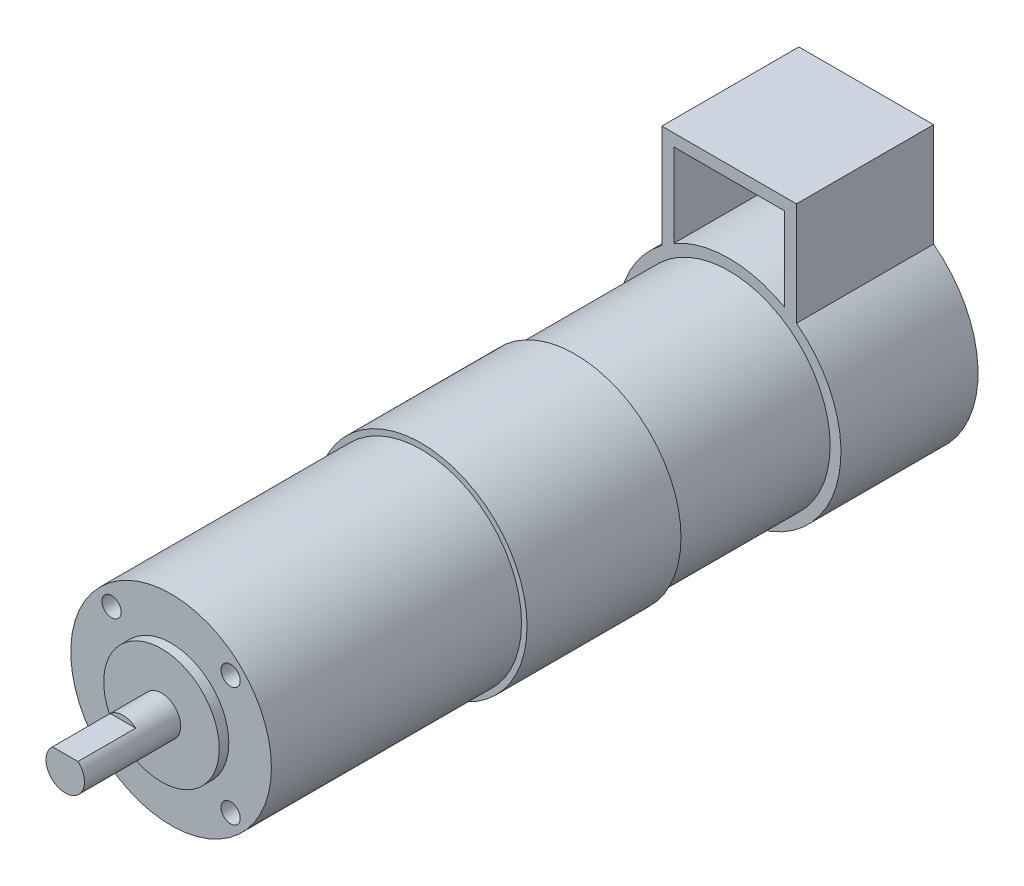
ISO-10303-21;
HEADER;
FILE_DESCRIPTION(('STEP AP214'),'2;1');
FILE_NAME('part.step','',(''),(''),'','','');
FILE_SCHEMA(('AUTOMOTIVE_DESIGN { 1 0 10303 214 1 1 1 1 }'));
ENDSEC;
DATA;
#1=APPLICATION_CONTEXT('core data for automotive mechanical design processes');
#2=APPLICATION_PROTOCOL_DEFINITION('international standard','automotive_design',2000,#1);
#3=PRODUCT_CONTEXT('',#1,'mechanical');
#4=PRODUCT('Part','Part','',(#3));
#5=PRODUCT_RELATED_PRODUCT_CATEGORY('part','',(#4));
#6=PRODUCT_DEFINITION_FORMATION('','',#4);
#7=PRODUCT_DEFINITION_CONTEXT('part definition',#1,'design');
#8=PRODUCT_DEFINITION('design','',#6,#7);
#9=PRODUCT_DEFINITION_SHAPE('','',#8);
#10=(LENGTH_UNIT() NAMED_UNIT(*) SI_UNIT(.MILLI.,.METRE.));
#11=(NAMED_UNIT(*) PLANE_ANGLE_UNIT() SI_UNIT($,.RADIAN.));
#12=(NAMED_UNIT(*) SI_UNIT($,.STERADIAN.) SOLID_ANGLE_UNIT());
#13=UNCERTAINTY_MEASURE_WITH_UNIT(LENGTH_MEASURE(1.E-05),#10,'distance_accuracy_value','');
#14=(GEOMETRIC_REPRESENTATION_CONTEXT(3) GLOBAL_UNCERTAINTY_ASSIGNED_CONTEXT((#13)) GLOBAL_UNIT_ASSIGNED_CONTEXT((#10,
#11,#12)) REPRESENTATION_CONTEXT('',''));
#15=CARTESIAN_POINT('',(0.,0.,0.));
#16=DIRECTION('',(0.,0.,1.));
#17=DIRECTION('',(1.,0.,0.));
#18=AXIS2_PLACEMENT_3D('',#15,#16,#17);
#19=CARTESIAN_POINT('',(0.,0.,-76.5));
#20=DIRECTION('',(0.,0.,1.));
#21=DIRECTION('',(1.,0.,0.));
#22=AXIS2_PLACEMENT_3D('',#19,#20,#21);
#23=CYLINDRICAL_SURFACE('',#22,23.25);
#24=CARTESIAN_POINT('',(0.,0.,-74.5));
#25=DIRECTION('',(0.,0.,-1.));
#26=DIRECTION('',(-1.,0.,0.));
#27=AXIS2_PLACEMENT_3D('',#24,#25,#26);
#28=CIRCLE('',#27,23.25);
#29=CARTESIAN_POINT('',(-11.5,20.2067439237498,-74.5));
#30=VERTEX_POINT('',#29);
#31=CARTESIAN_POINT('',(11.5,20.2067439237498,-74.5));
#32=VERTEX_POINT('',#31);
#33=EDGE_CURVE('E58',#30,#32,#28,.T.);
#34=ORIENTED_EDGE('',*,*,#33,.F.);
#35=DIRECTION('',(0.,0.,-1.));
#36=VECTOR('',#35,1.);
#37=CARTESIAN_POINT('',(-11.5,20.2067439237498,-48.));
#38=LINE('',#37,#36);
#39=CARTESIAN_POINT('',(-11.5,20.2067439237498,-48.));
#40=VERTEX_POINT('',#39);
#41=EDGE_CURVE('E201',#40,#30,#38,.T.);
#42=ORIENTED_EDGE('',*,*,#41,.F.);
#43=CARTESIAN_POINT('',(0.,0.,-48.));
#44=DIRECTION('',(0.,0.,-1.));
#45=DIRECTION('',(-1.,0.,0.));
#46=AXIS2_PLACEMENT_3D('',#43,#44,#45);
#47=CIRCLE('',#46,23.25);
#48=CARTESIAN_POINT('',(11.5,20.2067439237498,-48.));
#49=VERTEX_POINT('',#48);
#50=EDGE_CURVE('E218',#40,#49,#47,.T.);
#51=ORIENTED_EDGE('',*,*,#50,.T.);
#52=DIRECTION('',(0.,0.,-1.));
#53=VECTOR('',#52,1.);
#54=CARTESIAN_POINT('',(11.5,20.2067439237498,-48.));
#55=LINE('',#54,#53);
#56=EDGE_CURVE('E208',#49,#32,#55,.T.);
#57=ORIENTED_EDGE('',*,*,#56,.T.);
#58=EDGE_LOOP('',(#34,#42,#51,#57));
#59=FACE_BOUND('',#58,.T.);
#60=ADVANCED_FACE('F35',(#59),#23,.T.);
#61=CARTESIAN_POINT('',(-11.5,37.5623947808466,-48.));
#62=DIRECTION('',(1.,0.,0.));
#63=DIRECTION('',(0.,0.,-1.));
#64=AXIS2_PLACEMENT_3D('',#61,#62,#63);
#65=PLANE('',#64);
#66=ORIENTED_EDGE('',*,*,#41,.T.);
#67=DIRECTION('',(0.,1.,0.));
#68=VECTOR('',#67,1.);
#69=CARTESIAN_POINT('',(-11.5,37.5623947808466,-74.5));
#70=LINE('',#69,#68);
#71=CARTESIAN_POINT('',(-11.5,37.5623947808466,-74.5));
#72=VERTEX_POINT('',#71);
#73=EDGE_CURVE('E131',#30,#72,#70,.T.);
#74=ORIENTED_EDGE('',*,*,#73,.T.);
#75=DIRECTION('',(0.,0.,-1.));
#76=VECTOR('',#75,1.);
#77=CARTESIAN_POINT('',(-11.5,37.5623947808466,-48.));
#78=LINE('',#77,#76);
#79=CARTESIAN_POINT('',(-11.5,37.5623947808466,-48.));
#80=VERTEX_POINT('',#79);
#81=EDGE_CURVE('E203',#80,#72,#78,.T.);
#82=ORIENTED_EDGE('',*,*,#81,.F.);
#83=DIRECTION('',(0.,-1.,0.));
#84=VECTOR('',#83,1.);
#85=CARTESIAN_POINT('',(-11.5,37.5623947808466,-48.));
#86=LINE('',#85,#84);
#87=EDGE_CURVE('E182',#80,#40,#86,.T.);
#88=ORIENTED_EDGE('',*,*,#87,.T.);
#89=EDGE_LOOP('',(#66,#74,#82,#88));
#90=FACE_BOUND('',#89,.T.);
#91=ADVANCED_FACE('F255',(#90),#65,.T.);
#92=CARTESIAN_POINT('',(-11.5,37.5623947808466,-48.));
#93=DIRECTION('',(0.,1.,0.));
#94=DIRECTION('',(0.,0.,1.));
#95=AXIS2_PLACEMENT_3D('',#92,#93,#94);
#96=PLANE('',#95);
#97=DIRECTION('',(-1.,0.,0.));
#98=VECTOR('',#97,1.);
#99=CARTESIAN_POINT('',(-11.5,37.5623947808466,-74.5));
#100=LINE('',#99,#98);
#101=CARTESIAN_POINT('',(11.5,37.5623947808466,-74.5));
#102=VERTEX_POINT('',#101);
#103=EDGE_CURVE('E127',#102,#72,#100,.T.);
#104=ORIENTED_EDGE('',*,*,#103,.F.);
#105=DIRECTION('',(0.,0.,-1.));
#106=VECTOR('',#105,1.);
#107=CARTESIAN_POINT('',(11.5,37.5623947808466,-48.));
#108=LINE('',#107,#106);
#109=CARTESIAN_POINT('',(11.5,37.5623947808466,-48.));
#110=VERTEX_POINT('',#109);
#111=EDGE_CURVE('E206',#110,#102,#108,.T.);
#112=ORIENTED_EDGE('',*,*,#111,.F.);
#113=DIRECTION('',(1.,0.,0.));
#114=VECTOR('',#113,1.);
#115=CARTESIAN_POINT('',(-11.5,37.5623947808466,-48.));
#116=LINE('',#115,#114);
#117=EDGE_CURVE('E180',#80,#110,#116,.T.);
#118=ORIENTED_EDGE('',*,*,#117,.F.);
#119=ORIENTED_EDGE('',*,*,#81,.T.);
#120=EDGE_LOOP('',(#104,#112,#118,#119));
#121=FACE_BOUND('',#120,.T.);
#122=ADVANCED_FACE('F253',(#121),#96,.F.);
#123=CARTESIAN_POINT('',(11.5,37.5623947808466,-48.));
#124=DIRECTION('',(1.,0.,0.));
#125=DIRECTION('',(0.,0.,-1.));
#126=AXIS2_PLACEMENT_3D('',#123,#124,#125);
#127=PLANE('',#126);
#128=DIRECTION('',(0.,1.,0.));
#129=VECTOR('',#128,1.);
#130=CARTESIAN_POINT('',(11.5,37.5623947808466,-74.5));
#131=LINE('',#130,#129);
#132=EDGE_CURVE('E119',#32,#102,#131,.T.);
#133=ORIENTED_EDGE('',*,*,#132,.F.);
#134=ORIENTED_EDGE('',*,*,#56,.F.);
#135=DIRECTION('',(0.,-1.,0.));
#136=VECTOR('',#135,1.);
#137=CARTESIAN_POINT('',(11.5,37.5623947808466,-48.));
#138=LINE('',#137,#136);
#139=EDGE_CURVE('E177',#110,#49,#138,.T.);
#140=ORIENTED_EDGE('',*,*,#139,.F.);
#141=ORIENTED_EDGE('',*,*,#111,.T.);
#142=EDGE_LOOP('',(#133,#134,#140,#141));
#143=FACE_BOUND('',#142,.T.);
#144=ADVANCED_FACE('F244',(#143),#127,.F.);
#145=DIRECTION('',(0.,0.,-1.));
#146=VECTOR('',#145,1.);
#147=CARTESIAN_POINT('',(-14.,18.5623947808466,-48.));
#148=LINE('',#147,#146);
#149=CARTESIAN_POINT('',(-14.,18.5623947808466,-48.));
#150=VERTEX_POINT('',#149);
#151=CARTESIAN_POINT('',(-14.,18.5623947808466,-76.5));
#152=VERTEX_POINT('',#151);
#153=EDGE_CURVE('E199',#150,#152,#148,.T.);
#154=ORIENTED_EDGE('',*,*,#153,.T.);
#155=CARTESIAN_POINT('',(0.,0.,-76.5));
#156=DIRECTION('',(0.,0.,-1.));
#157=DIRECTION('',(-1.,0.,0.));
#158=AXIS2_PLACEMENT_3D('',#155,#156,#157);
#159=CIRCLE('',#158,23.25);
#160=CARTESIAN_POINT('',(14.,18.5623947808466,-76.5));
#161=VERTEX_POINT('',#160);
#162=EDGE_CURVE('E214',#161,#152,#159,.T.);
#163=ORIENTED_EDGE('',*,*,#162,.F.);
#164=DIRECTION('',(0.,0.,-1.));
#165=VECTOR('',#164,1.);
#166=CARTESIAN_POINT('',(14.,18.5623947808466,-48.));
#167=LINE('',#166,#165);
#168=CARTESIAN_POINT('',(14.,18.5623947808466,-48.));
#169=VERTEX_POINT('',#168);
#170=EDGE_CURVE('E210',#169,#161,#167,.T.);
#171=ORIENTED_EDGE('',*,*,#170,.F.);
#172=EDGE_CURVE('E198',#169,#150,#47,.T.);
#173=ORIENTED_EDGE('',*,*,#172,.T.);
#174=EDGE_LOOP('',(#154,#163,#171,#173));
#175=FACE_BOUND('',#174,.T.);
#176=ADVANCED_FACE('F264',(#175),#23,.T.);
#177=CARTESIAN_POINT('',(0.,0.,-16.));
#178=DIRECTION('',(0.,0.,1.));
#179=DIRECTION('',(1.,0.,0.));
#180=AXIS2_PLACEMENT_3D('',#177,#178,#179);
#181=CYLINDRICAL_SURFACE('',#180,22.);
#182=CARTESIAN_POINT('',(0.,0.,-16.));
#183=DIRECTION('',(0.,0.,1.));
#184=DIRECTION('',(1.,0.,0.));
#185=AXIS2_PLACEMENT_3D('',#182,#183,#184);
#186=CIRCLE('',#185,22.);
#187=CARTESIAN_POINT('',(22.,0.,-16.));
#188=VERTEX_POINT('',#187);
#189=EDGE_CURVE('E231',#188,#188,#186,.T.);
#190=ORIENTED_EDGE('',*,*,#189,.T.);
#191=EDGE_LOOP('',(#190));
#192=FACE_BOUND('',#191,.T.);
#193=CARTESIAN_POINT('',(0.,0.,16.));
#194=DIRECTION('',(0.,0.,1.));
#195=DIRECTION('',(1.,0.,0.));
#196=AXIS2_PLACEMENT_3D('',#193,#194,#195);
#197=CIRCLE('',#196,22.);
#198=CARTESIAN_POINT('',(22.,0.,16.));
#199=VERTEX_POINT('',#198);
#200=EDGE_CURVE('E228',#199,#199,#197,.T.);
#201=ORIENTED_EDGE('',*,*,#200,.F.);
#202=EDGE_LOOP('',(#201));
#203=FACE_BOUND('',#202,.T.);
#204=ADVANCED_FACE('F37',(#192,#203),#181,.T.);
#205=CARTESIAN_POINT('',(0.,0.,-16.));
#206=DIRECTION('',(0.,0.,1.));
#207=DIRECTION('',(1.,0.,0.));
#208=AXIS2_PLACEMENT_3D('',#205,#206,#207);
#209=PLANE('',#208);
#210=CARTESIAN_POINT('',(0.,0.,-16.));
#211=DIRECTION('',(0.,0.,1.));
#212=DIRECTION('',(1.,0.,0.));
#213=AXIS2_PLACEMENT_3D('',#210,#211,#212);
#214=CIRCLE('',#213,21.);
#215=CARTESIAN_POINT('',(21.,0.,-16.));
#216=VERTEX_POINT('',#215);
#217=EDGE_CURVE('E234',#216,#216,#214,.F.);
#218=ORIENTED_EDGE('',*,*,#217,.F.);
#219=EDGE_LOOP('',(#218));
#220=FACE_BOUND('',#219,.T.);
#221=ORIENTED_EDGE('',*,*,#189,.F.);
#222=EDGE_LOOP('',(#221));
#223=FACE_BOUND('',#222,.T.);
#224=ADVANCED_FACE('F302',(#220,#223),#209,.F.);
#225=CARTESIAN_POINT('',(0.,0.,16.));
#226=DIRECTION('',(0.,0.,1.));
#227=DIRECTION('',(1.,0.,0.));
#228=AXIS2_PLACEMENT_3D('',#225,#226,#227);
#229=PLANE('',#228);
#230=CARTESIAN_POINT('',(0.,0.,16.));
#231=DIRECTION('',(0.,0.,1.));
#232=DIRECTION('',(1.,0.,0.));
#233=AXIS2_PLACEMENT_3D('',#230,#231,#232);
#234=CIRCLE('',#233,20.85);
#235=CARTESIAN_POINT('',(20.85,0.,16.));
#236=VERTEX_POINT('',#235);
#237=EDGE_CURVE('E225',#236,#236,#234,.T.);
#238=ORIENTED_EDGE('',*,*,#237,.F.);
#239=EDGE_LOOP('',(#238));
#240=FACE_BOUND('',#239,.T.);
#241=ORIENTED_EDGE('',*,*,#200,.T.);
#242=EDGE_LOOP('',(#241));
#243=FACE_BOUND('',#242,.T.);
#244=ADVANCED_FACE('F299',(#240,#243),#229,.T.);
#245=CARTESIAN_POINT('',(0.,0.,24.));
#246=DIRECTION('',(0.,0.,-1.));
#247=DIRECTION('',(-1.,0.,0.));
#248=AXIS2_PLACEMENT_3D('',#245,#246,#247);
#249=CYLINDRICAL_SURFACE('',#248,20.85);
#250=ORIENTED_EDGE('',*,*,#237,.T.);
#251=EDGE_LOOP('',(#250));
#252=FACE_BOUND('',#251,.T.);
#253=CARTESIAN_POINT('',(0.,0.,68.));
#254=DIRECTION('',(0.,0.,1.));
#255=DIRECTION('',(1.,0.,0.));
#256=AXIS2_PLACEMENT_3D('',#253,#254,#255);
#257=CIRCLE('',#256,20.85);
#258=CARTESIAN_POINT('',(20.85,0.,68.));
#259=VERTEX_POINT('',#258);
#260=EDGE_CURVE('E222',#259,#259,#257,.T.);
#261=ORIENTED_EDGE('',*,*,#260,.F.);
#262=EDGE_LOOP('',(#261));
#263=FACE_BOUND('',#262,.T.);
#264=ADVANCED_FACE('F295',(#252,#263),#249,.T.);
#265=CARTESIAN_POINT('',(0.,0.,68.));
#266=DIRECTION('',(0.,0.,1.));
#267=DIRECTION('',(1.,0.,0.));
#268=AXIS2_PLACEMENT_3D('',#265,#266,#267);
#269=PLANE('',#268);
#270=CARTESIAN_POINT('',(12.3743686707653,-12.3743686707646,68.));
#271=DIRECTION('',(0.,0.,1.));
#272=DIRECTION('',(1.,0.,0.));
#273=AXIS2_PLACEMENT_3D('',#270,#271,#272);
#274=CIRCLE('',#273,1.99999999999983);
#275=CARTESIAN_POINT('',(14.3743686707651,-12.3743686707646,68.));
#276=VERTEX_POINT('',#275);
#277=EDGE_CURVE('E144',#276,#276,#274,.T.);
#278=ORIENTED_EDGE('',*,*,#277,.F.);
#279=EDGE_LOOP('',(#278));
#280=FACE_BOUND('',#279,.T.);
#281=CARTESIAN_POINT('',(-12.3743686707639,-12.3743686707653,68.));
#282=DIRECTION('',(0.,0.,1.));
#283=DIRECTION('',(1.,0.,0.));
#284=AXIS2_PLACEMENT_3D('',#281,#282,#283);
#285=CIRCLE('',#284,2.00000000000052);
#286=CARTESIAN_POINT('',(-10.3743686707633,-12.3743686707653,68.));
#287=VERTEX_POINT('',#286);
#288=EDGE_CURVE('E150',#287,#287,#285,.T.);
#289=ORIENTED_EDGE('',*,*,#288,.F.);
#290=EDGE_LOOP('',(#289));
#291=FACE_BOUND('',#290,.T.);
#292=CARTESIAN_POINT('',(-12.3743686707646,12.3743686707639,68.));
#293=DIRECTION('',(0.,0.,1.));
#294=DIRECTION('',(1.,0.,0.));
#295=AXIS2_PLACEMENT_3D('',#292,#293,#294);
#296=CIRCLE('',#295,2.00000000000074);
#297=CARTESIAN_POINT('',(-10.3743686707639,12.3743686707639,68.));
#298=VERTEX_POINT('',#297);
#299=EDGE_CURVE('E139',#298,#298,#296,.T.);
#300=ORIENTED_EDGE('',*,*,#299,.F.);
#301=EDGE_LOOP('',(#300));
#302=FACE_BOUND('',#301,.T.);
#303=CARTESIAN_POINT('',(12.3743686707646,12.3743686707646,68.));
#304=DIRECTION('',(0.,0.,1.));
#305=DIRECTION('',(1.,0.,0.));
#306=AXIS2_PLACEMENT_3D('',#303,#304,#305);
#307=CIRCLE('',#306,2.);
#308=CARTESIAN_POINT('',(14.3743686707646,12.3743686707646,68.));
#309=VERTEX_POINT('',#308);
#310=EDGE_CURVE('E143',#309,#309,#307,.T.);
#311=ORIENTED_EDGE('',*,*,#310,.F.);
#312=EDGE_LOOP('',(#311));
#313=FACE_BOUND('',#312,.T.);
#314=CARTESIAN_POINT('',(0.,0.,68.));
#315=DIRECTION('',(0.,0.,1.));
#316=DIRECTION('',(1.,0.,0.));
#317=AXIS2_PLACEMENT_3D('',#314,#315,#316);
#318=CIRCLE('',#317,12.);
#319=CARTESIAN_POINT('',(12.,0.,68.));
#320=VERTEX_POINT('',#319);
#321=EDGE_CURVE('E161',#320,#320,#318,.T.);
#322=ORIENTED_EDGE('',*,*,#321,.F.);
#323=EDGE_LOOP('',(#322));
#324=FACE_BOUND('',#323,.T.);
#325=ORIENTED_EDGE('',*,*,#260,.T.);
#326=EDGE_LOOP('',(#325));
#327=FACE_BOUND('',#326,.T.);
#328=ADVANCED_FACE('F291',(#280,#291,#302,#313,#324,#327),#269,.T.);
#329=CARTESIAN_POINT('',(0.,0.,-48.));
#330=DIRECTION('',(0.,0.,1.));
#331=DIRECTION('',(1.,0.,0.));
#332=AXIS2_PLACEMENT_3D('',#329,#330,#331);
#333=CYLINDRICAL_SURFACE('',#332,21.);
#334=CARTESIAN_POINT('',(0.,0.,-48.));
#335=DIRECTION('',(0.,0.,-1.));
#336=DIRECTION('',(-1.,0.,0.));
#337=AXIS2_PLACEMENT_3D('',#334,#335,#336);
#338=CIRCLE('',#337,21.);
#339=CARTESIAN_POINT('',(-21.,0.,-48.));
#340=VERTEX_POINT('',#339);
#341=EDGE_CURVE('E217',#340,#340,#338,.T.);
#342=ORIENTED_EDGE('',*,*,#341,.F.);
#343=EDGE_LOOP('',(#342));
#344=FACE_BOUND('',#343,.T.);
#345=ORIENTED_EDGE('',*,*,#217,.T.);
#346=EDGE_LOOP('',(#345));
#347=FACE_BOUND('',#346,.T.);
#348=ADVANCED_FACE('F283',(#344,#347),#333,.T.);
#349=CARTESIAN_POINT('',(0.,0.,-76.5));
#350=DIRECTION('',(0.,0.,-1.));
#351=DIRECTION('',(-1.,0.,0.));
#352=AXIS2_PLACEMENT_3D('',#349,#350,#351);
#353=PLANE('',#352);
#354=ORIENTED_EDGE('',*,*,#162,.T.);
#355=DIRECTION('',(0.,-1.,0.));
#356=VECTOR('',#355,1.);
#357=CARTESIAN_POINT('',(-14.,40.0623947808466,-76.5));
#358=LINE('',#357,#356);
#359=CARTESIAN_POINT('',(-14.,40.0623947808466,-76.5));
#360=VERTEX_POINT('',#359);
#361=EDGE_CURVE('E174',#360,#152,#358,.T.);
#362=ORIENTED_EDGE('',*,*,#361,.F.);
#363=DIRECTION('',(1.,0.,0.));
#364=VECTOR('',#363,1.);
#365=CARTESIAN_POINT('',(-14.,40.0623947808466,-76.5));
#366=LINE('',#365,#364);
#367=CARTESIAN_POINT('',(14.,40.0623947808466,-76.5));
#368=VERTEX_POINT('',#367);
#369=EDGE_CURVE('E167',#360,#368,#366,.T.);
#370=ORIENTED_EDGE('',*,*,#369,.T.);
#371=DIRECTION('',(0.,-1.,0.));
#372=VECTOR('',#371,1.);
#373=CARTESIAN_POINT('',(14.,40.0623947808466,-76.5));
#374=LINE('',#373,#372);
#375=EDGE_CURVE('E191',#368,#161,#374,.T.);
#376=ORIENTED_EDGE('',*,*,#375,.T.);
#377=EDGE_LOOP('',(#354,#362,#370,#376));
#378=FACE_BOUND('',#377,.T.);
#379=ADVANCED_FACE('F280',(#378),#353,.T.);
#380=CARTESIAN_POINT('',(0.,0.,-48.));
#381=DIRECTION('',(0.,0.,-1.));
#382=DIRECTION('',(-1.,0.,0.));
#383=AXIS2_PLACEMENT_3D('',#380,#381,#382);
#384=PLANE('',#383);
#385=ORIENTED_EDGE('',*,*,#50,.F.);
#386=ORIENTED_EDGE('',*,*,#87,.F.);
#387=ORIENTED_EDGE('',*,*,#117,.T.);
#388=ORIENTED_EDGE('',*,*,#139,.T.);
#389=EDGE_LOOP('',(#385,#386,#387,#388));
#390=FACE_BOUND('',#389,.T.);
#391=ORIENTED_EDGE('',*,*,#341,.T.);
#392=EDGE_LOOP('',(#391));
#393=FACE_BOUND('',#392,.T.);
#394=DIRECTION('',(0.,-1.,0.));
#395=VECTOR('',#394,1.);
#396=CARTESIAN_POINT('',(-14.,40.0623947808466,-48.));
#397=LINE('',#396,#395);
#398=CARTESIAN_POINT('',(-14.,40.0623947808466,-48.));
#399=VERTEX_POINT('',#398);
#400=EDGE_CURVE('E185',#399,#150,#397,.T.);
#401=ORIENTED_EDGE('',*,*,#400,.T.);
#402=ORIENTED_EDGE('',*,*,#172,.F.);
#403=DIRECTION('',(0.,-1.,0.));
#404=VECTOR('',#403,1.);
#405=CARTESIAN_POINT('',(14.,40.0623947808466,-48.));
#406=LINE('',#405,#404);
#407=CARTESIAN_POINT('',(14.,40.0623947808466,-48.));
#408=VERTEX_POINT('',#407);
#409=EDGE_CURVE('E173',#408,#169,#406,.T.);
#410=ORIENTED_EDGE('',*,*,#409,.F.);
#411=DIRECTION('',(1.,0.,0.));
#412=VECTOR('',#411,1.);
#413=CARTESIAN_POINT('',(-14.,40.0623947808466,-48.));
#414=LINE('',#413,#412);
#415=EDGE_CURVE('E170',#399,#408,#414,.T.);
#416=ORIENTED_EDGE('',*,*,#415,.F.);
#417=EDGE_LOOP('',(#401,#402,#410,#416));
#418=FACE_BOUND('',#417,.T.);
#419=ADVANCED_FACE('F249',(#390,#393,#418),#384,.F.);
#420=CARTESIAN_POINT('',(-14.,40.0623947808466,-48.));
#421=DIRECTION('',(0.,1.,0.));
#422=DIRECTION('',(0.,0.,1.));
#423=AXIS2_PLACEMENT_3D('',#420,#421,#422);
#424=PLANE('',#423);
#425=ORIENTED_EDGE('',*,*,#369,.F.);
#426=DIRECTION('',(0.,0.,-1.));
#427=VECTOR('',#426,1.);
#428=CARTESIAN_POINT('',(-14.,40.0623947808466,-48.));
#429=LINE('',#428,#427);
#430=EDGE_CURVE('E196',#399,#360,#429,.T.);
#431=ORIENTED_EDGE('',*,*,#430,.F.);
#432=ORIENTED_EDGE('',*,*,#415,.T.);
#433=DIRECTION('',(0.,0.,-1.));
#434=VECTOR('',#433,1.);
#435=CARTESIAN_POINT('',(14.,40.0623947808466,-48.));
#436=LINE('',#435,#434);
#437=EDGE_CURVE('E188',#408,#368,#436,.T.);
#438=ORIENTED_EDGE('',*,*,#437,.T.);
#439=EDGE_LOOP('',(#425,#431,#432,#438));
#440=FACE_BOUND('',#439,.T.);
#441=ADVANCED_FACE('F276',(#440),#424,.T.);
#442=CARTESIAN_POINT('',(-14.,40.0623947808466,-48.));
#443=DIRECTION('',(1.,0.,0.));
#444=DIRECTION('',(0.,0.,-1.));
#445=AXIS2_PLACEMENT_3D('',#442,#443,#444);
#446=PLANE('',#445);
#447=ORIENTED_EDGE('',*,*,#361,.T.);
#448=ORIENTED_EDGE('',*,*,#153,.F.);
#449=ORIENTED_EDGE('',*,*,#400,.F.);
#450=ORIENTED_EDGE('',*,*,#430,.T.);
#451=EDGE_LOOP('',(#447,#448,#449,#450));
#452=FACE_BOUND('',#451,.T.);
#453=ADVANCED_FACE('F266',(#452),#446,.F.);
#454=CARTESIAN_POINT('',(14.,40.0623947808466,-48.));
#455=DIRECTION('',(1.,0.,0.));
#456=DIRECTION('',(0.,0.,-1.));
#457=AXIS2_PLACEMENT_3D('',#454,#455,#456);
#458=PLANE('',#457);
#459=ORIENTED_EDGE('',*,*,#375,.F.);
#460=ORIENTED_EDGE('',*,*,#437,.F.);
#461=ORIENTED_EDGE('',*,*,#409,.T.);
#462=ORIENTED_EDGE('',*,*,#170,.T.);
#463=EDGE_LOOP('',(#459,#460,#461,#462));
#464=FACE_BOUND('',#463,.T.);
#465=ADVANCED_FACE('F271',(#464),#458,.T.);
#466=CARTESIAN_POINT('',(0.,0.,70.));
#467=DIRECTION('',(0.,0.,-1.));
#468=DIRECTION('',(-1.,0.,0.));
#469=AXIS2_PLACEMENT_3D('',#466,#467,#468);
#470=CYLINDRICAL_SURFACE('',#469,12.);
#471=CARTESIAN_POINT('',(0.,0.,70.));
#472=DIRECTION('',(0.,0.,1.));
#473=DIRECTION('',(1.,0.,0.));
#474=AXIS2_PLACEMENT_3D('',#471,#472,#473);
#475=CIRCLE('',#474,12.);
#476=CARTESIAN_POINT('',(12.,0.,70.));
#477=VERTEX_POINT('',#476);
#478=EDGE_CURVE('E164',#477,#477,#475,.T.);
#479=ORIENTED_EDGE('',*,*,#478,.F.);
#480=EDGE_LOOP('',(#479));
#481=FACE_BOUND('',#480,.T.);
#482=ORIENTED_EDGE('',*,*,#321,.T.);
#483=EDGE_LOOP('',(#482));
#484=FACE_BOUND('',#483,.T.);
#485=ADVANCED_FACE('F274',(#481,#484),#470,.T.);
#486=CARTESIAN_POINT('',(0.,0.,70.));
#487=DIRECTION('',(0.,0.,1.));
#488=DIRECTION('',(1.,0.,0.));
#489=AXIS2_PLACEMENT_3D('',#486,#487,#488);
#490=PLANE('',#489);
#491=CARTESIAN_POINT('',(0.,0.,70.));
#492=DIRECTION('',(0.,0.,1.));
#493=DIRECTION('',(1.,0.,0.));
#494=AXIS2_PLACEMENT_3D('',#491,#492,#493);
#495=CIRCLE('',#494,4.);
#496=CARTESIAN_POINT('',(4.,0.,70.));
#497=VERTEX_POINT('',#496);
#498=EDGE_CURVE('E128',#497,#497,#495,.T.);
#499=ORIENTED_EDGE('',*,*,#498,.F.);
#500=EDGE_LOOP('',(#499));
#501=FACE_BOUND('',#500,.T.);
#502=ORIENTED_EDGE('',*,*,#478,.T.);
#503=EDGE_LOOP('',(#502));
#504=FACE_BOUND('',#503,.T.);
#505=ADVANCED_FACE('F431',(#501,#504),#490,.T.);
#506=CARTESIAN_POINT('',(12.3743686707646,12.3743686707646,62.));
#507=DIRECTION('',(0.,0.,1.));
#508=DIRECTION('',(1.,0.,0.));
#509=AXIS2_PLACEMENT_3D('',#506,#507,#508);
#510=CYLINDRICAL_SURFACE('',#509,2.);
#511=CARTESIAN_POINT('',(12.3743686707646,12.3743686707646,62.));
#512=DIRECTION('',(0.,0.,1.));
#513=DIRECTION('',(1.,0.,0.));
#514=AXIS2_PLACEMENT_3D('',#511,#512,#513);
#515=CIRCLE('',#514,2.);
#516=CARTESIAN_POINT('',(14.3743686707646,12.3743686707646,62.));
#517=VERTEX_POINT('',#516);
#518=EDGE_CURVE('E158',#517,#517,#515,.T.);
#519=ORIENTED_EDGE('',*,*,#518,.F.);
#520=EDGE_LOOP('',(#519));
#521=FACE_BOUND('',#520,.T.);
#522=ORIENTED_EDGE('',*,*,#310,.T.);
#523=EDGE_LOOP('',(#522));
#524=FACE_BOUND('',#523,.T.);
#525=ADVANCED_FACE('F421',(#521,#524),#510,.F.);
#526=CARTESIAN_POINT('',(12.3743686707646,12.3743686707646,62.));
#527=DIRECTION('',(0.,0.,1.));
#528=DIRECTION('',(1.,0.,0.));
#529=AXIS2_PLACEMENT_3D('',#526,#527,#528);
#530=PLANE('',#529);
#531=ORIENTED_EDGE('',*,*,#518,.T.);
#532=EDGE_LOOP('',(#531));
#533=FACE_BOUND('',#532,.T.);
#534=ADVANCED_FACE('F411',(#533),#530,.T.);
#535=CARTESIAN_POINT('',(-12.3743686707646,12.3743686707639,62.));
#536=DIRECTION('',(0.,0.,1.));
#537=DIRECTION('',(1.,0.,0.));
#538=AXIS2_PLACEMENT_3D('',#535,#536,#537);
#539=CYLINDRICAL_SURFACE('',#538,2.00000000000074);
#540=CARTESIAN_POINT('',(-12.3743686707646,12.3743686707639,62.));
#541=DIRECTION('',(0.,0.,1.));
#542=DIRECTION('',(1.,0.,0.));
#543=AXIS2_PLACEMENT_3D('',#540,#541,#542);
#544=CIRCLE('',#543,2.00000000000074);
#545=CARTESIAN_POINT('',(-10.3743686707639,12.3743686707639,62.));
#546=VERTEX_POINT('',#545);
#547=EDGE_CURVE('E153',#546,#546,#544,.T.);
#548=ORIENTED_EDGE('',*,*,#547,.F.);
#549=EDGE_LOOP('',(#548));
#550=FACE_BOUND('',#549,.T.);
#551=ORIENTED_EDGE('',*,*,#299,.T.);
#552=EDGE_LOOP('',(#551));
#553=FACE_BOUND('',#552,.T.);
#554=ADVANCED_FACE('F401',(#550,#553),#539,.F.);
#555=CARTESIAN_POINT('',(-12.3743686707646,12.3743686707639,62.));
#556=DIRECTION('',(0.,0.,1.));
#557=DIRECTION('',(1.,0.,0.));
#558=AXIS2_PLACEMENT_3D('',#555,#556,#557);
#559=PLANE('',#558);
#560=ORIENTED_EDGE('',*,*,#547,.T.);
#561=EDGE_LOOP('',(#560));
#562=FACE_BOUND('',#561,.T.);
#563=ADVANCED_FACE('F391',(#562),#559,.T.);
#564=CARTESIAN_POINT('',(-12.3743686707639,-12.3743686707653,62.));
#565=DIRECTION('',(0.,0.,1.));
#566=DIRECTION('',(1.,0.,0.));
#567=AXIS2_PLACEMENT_3D('',#564,#565,#566);
#568=CYLINDRICAL_SURFACE('',#567,2.00000000000052);
#569=CARTESIAN_POINT('',(-12.3743686707639,-12.3743686707653,62.));
#570=DIRECTION('',(0.,0.,1.));
#571=DIRECTION('',(1.,0.,0.));
#572=AXIS2_PLACEMENT_3D('',#569,#570,#571);
#573=CIRCLE('',#572,2.00000000000052);
#574=CARTESIAN_POINT('',(-10.3743686707633,-12.3743686707653,62.));
#575=VERTEX_POINT('',#574);
#576=EDGE_CURVE('E147',#575,#575,#573,.T.);
#577=ORIENTED_EDGE('',*,*,#576,.F.);
#578=EDGE_LOOP('',(#577));
#579=FACE_BOUND('',#578,.T.);
#580=ORIENTED_EDGE('',*,*,#288,.T.);
#581=EDGE_LOOP('',(#580));
#582=FACE_BOUND('',#581,.T.);
#583=ADVANCED_FACE('F381',(#579,#582),#568,.F.);
#584=CARTESIAN_POINT('',(-12.3743686707639,-12.3743686707653,62.));
#585=DIRECTION('',(0.,0.,1.));
#586=DIRECTION('',(1.,0.,0.));
#587=AXIS2_PLACEMENT_3D('',#584,#585,#586);
#588=PLANE('',#587);
#589=ORIENTED_EDGE('',*,*,#576,.T.);
#590=EDGE_LOOP('',(#589));
#591=FACE_BOUND('',#590,.T.);
#592=ADVANCED_FACE('F371',(#591),#588,.T.);
#593=CARTESIAN_POINT('',(12.3743686707653,-12.3743686707646,62.));
#594=DIRECTION('',(0.,0.,1.));
#595=DIRECTION('',(1.,0.,0.));
#596=AXIS2_PLACEMENT_3D('',#593,#594,#595);
#597=CYLINDRICAL_SURFACE('',#596,1.99999999999983);
#598=CARTESIAN_POINT('',(12.3743686707653,-12.3743686707646,62.));
#599=DIRECTION('',(0.,0.,1.));
#600=DIRECTION('',(1.,0.,0.));
#601=AXIS2_PLACEMENT_3D('',#598,#599,#600);
#602=CIRCLE('',#601,1.99999999999983);
#603=CARTESIAN_POINT('',(14.3743686707651,-12.3743686707646,62.));
#604=VERTEX_POINT('',#603);
#605=EDGE_CURVE('E140',#604,#604,#602,.T.);
#606=ORIENTED_EDGE('',*,*,#605,.F.);
#607=EDGE_LOOP('',(#606));
#608=FACE_BOUND('',#607,.T.);
#609=ORIENTED_EDGE('',*,*,#277,.T.);
#610=EDGE_LOOP('',(#609));
#611=FACE_BOUND('',#610,.T.);
#612=ADVANCED_FACE('F359',(#608,#611),#597,.F.);
#613=CARTESIAN_POINT('',(12.3743686707653,-12.3743686707646,62.));
#614=DIRECTION('',(0.,0.,1.));
#615=DIRECTION('',(1.,0.,0.));
#616=AXIS2_PLACEMENT_3D('',#613,#614,#615);
#617=PLANE('',#616);
#618=ORIENTED_EDGE('',*,*,#605,.T.);
#619=EDGE_LOOP('',(#618));
#620=FACE_BOUND('',#619,.T.);
#621=ADVANCED_FACE('F354',(#620),#617,.T.);
#622=CARTESIAN_POINT('',(0.,0.,-74.5));
#623=DIRECTION('',(0.,0.,-1.));
#624=DIRECTION('',(-1.,0.,0.));
#625=AXIS2_PLACEMENT_3D('',#622,#623,#624);
#626=PLANE('',#625);
#627=ORIENTED_EDGE('',*,*,#73,.F.);
#628=ORIENTED_EDGE('',*,*,#33,.T.);
#629=ORIENTED_EDGE('',*,*,#132,.T.);
#630=ORIENTED_EDGE('',*,*,#103,.T.);
#631=EDGE_LOOP('',(#627,#628,#629,#630));
#632=FACE_BOUND('',#631,.T.);
#633=ADVANCED_FACE('F240',(#632),#626,.F.);
#634=CARTESIAN_POINT('',(0.,0.,90.));
#635=DIRECTION('',(0.,0.,-1.));
#636=DIRECTION('',(-1.,0.,0.));
#637=AXIS2_PLACEMENT_3D('',#634,#635,#636);
#638=CYLINDRICAL_SURFACE('',#637,4.);
#639=CARTESIAN_POINT('',(0.,0.,90.));
#640=DIRECTION('',(0.,0.,1.));
#641=DIRECTION('',(1.,0.,0.));
#642=AXIS2_PLACEMENT_3D('',#639,#640,#641);
#643=CIRCLE('',#642,4.);
#644=CARTESIAN_POINT('',(-2.64575131106459,3.,90.));
#645=VERTEX_POINT('',#644);
#646=CARTESIAN_POINT('',(2.64575131106459,3.,90.));
#647=VERTEX_POINT('',#646);
#648=EDGE_CURVE('E123',#645,#647,#643,.T.);
#649=ORIENTED_EDGE('',*,*,#648,.F.);
#650=DIRECTION('',(0.,0.,-1.));
#651=VECTOR('',#650,1.);
#652=CARTESIAN_POINT('',(-2.64575131106459,3.,90.));
#653=LINE('',#652,#651);
#654=CARTESIAN_POINT('',(-2.64575131106459,3.,78.));
#655=VERTEX_POINT('',#654);
#656=EDGE_CURVE('E50',#645,#655,#653,.T.);
#657=ORIENTED_EDGE('',*,*,#656,.T.);
#658=CARTESIAN_POINT('',(0.,0.,78.));
#659=DIRECTION('',(0.,0.,-1.));
#660=DIRECTION('',(-1.,0.,0.));
#661=AXIS2_PLACEMENT_3D('',#658,#659,#660);
#662=CIRCLE('',#661,4.);
#663=CARTESIAN_POINT('',(2.64575131106459,3.,78.));
#664=VERTEX_POINT('',#663);
#665=EDGE_CURVE('E11',#655,#664,#662,.T.);
#666=ORIENTED_EDGE('',*,*,#665,.T.);
#667=DIRECTION('',(0.,0.,-1.));
#668=VECTOR('',#667,1.);
#669=CARTESIAN_POINT('',(2.64575131106459,3.,90.));
#670=LINE('',#669,#668);
#671=EDGE_CURVE('E114',#664,#647,#670,.F.);
#672=ORIENTED_EDGE('',*,*,#671,.T.);
#673=EDGE_LOOP('',(#649,#657,#666,#672));
#674=FACE_BOUND('',#673,.T.);
#675=ORIENTED_EDGE('',*,*,#498,.T.);
#676=EDGE_LOOP('',(#675));
#677=FACE_BOUND('',#676,.T.);
#678=ADVANCED_FACE('F121',(#674,#677),#638,.T.);
#679=CARTESIAN_POINT('',(0.,0.,90.));
#680=DIRECTION('',(0.,0.,1.));
#681=DIRECTION('',(1.,0.,0.));
#682=AXIS2_PLACEMENT_3D('',#679,#680,#681);
#683=PLANE('',#682);
#684=DIRECTION('',(1.,0.,0.));
#685=VECTOR('',#684,1.);
#686=CARTESIAN_POINT('',(0.,3.,90.));
#687=LINE('',#686,#685);
#688=EDGE_CURVE('E43',#645,#647,#687,.T.);
#689=ORIENTED_EDGE('',*,*,#688,.F.);
#690=ORIENTED_EDGE('',*,*,#648,.T.);
#691=EDGE_LOOP('',(#689,#690));
#692=FACE_BOUND('',#691,.T.);
#693=ADVANCED_FACE('F126',(#692),#683,.T.);
#694=CARTESIAN_POINT('',(0.,0.,78.));
#695=DIRECTION('',(0.,0.,-1.));
#696=DIRECTION('',(-1.,0.,0.));
#697=AXIS2_PLACEMENT_3D('',#694,#695,#696);
#698=PLANE('',#697);
#699=DIRECTION('',(1.,0.,0.));
#700=VECTOR('',#699,1.);
#701=CARTESIAN_POINT('',(0.,3.,78.));
#702=LINE('',#701,#700);
#703=EDGE_CURVE('E124',#655,#664,#702,.T.);
#704=ORIENTED_EDGE('',*,*,#703,.T.);
#705=ORIENTED_EDGE('',*,*,#665,.F.);
#706=EDGE_LOOP('',(#704,#705));
#707=FACE_BOUND('',#706,.T.);
#708=ADVANCED_FACE('F552',(#707),#698,.F.);
#709=CARTESIAN_POINT('',(0.,3.,78.));
#710=DIRECTION('',(0.,-1.,0.));
#711=DIRECTION('',(1.,0.,0.));
#712=AXIS2_PLACEMENT_3D('',#709,#710,#711);
#713=PLANE('',#712);
#714=ORIENTED_EDGE('',*,*,#688,.T.);
#715=ORIENTED_EDGE('',*,*,#671,.F.);
#716=ORIENTED_EDGE('',*,*,#703,.F.);
#717=ORIENTED_EDGE('',*,*,#656,.F.);
#718=EDGE_LOOP('',(#714,#715,#716,#717));
#719=FACE_BOUND('',#718,.T.);
#720=ADVANCED_FACE('F113',(#719),#713,.F.);
#721=CLOSED_SHELL('',(#60,#91,#122,#144,#176,#204,#224,#244,#264,#328,#348,#379,#419,#441,#453,
#465,#485,#505,#525,#534,#554,#563,#583,#592,#612,#621,#633,#678,#693,#708,#720));
#722=MANIFOLD_SOLID_BREP('B2',#721);
#723=ADVANCED_BREP_SHAPE_REPRESENTATION('',(#18,#722),#14);
#724=SHAPE_DEFINITION_REPRESENTATION(#9,#723);
ENDSEC;
END-ISO-10303-21;
